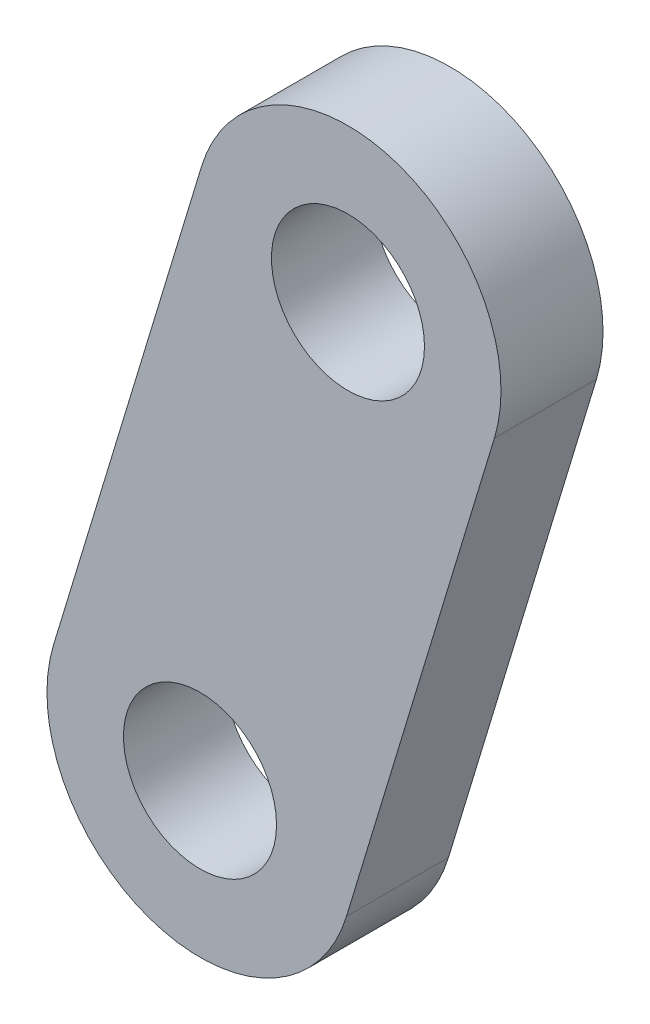
ISO-10303-21;
HEADER;
FILE_DESCRIPTION(('STEP AP214'),'2;1');
FILE_NAME('part.step','',(''),(''),'','','');
FILE_SCHEMA(('AUTOMOTIVE_DESIGN { 1 0 10303 214 1 1 1 1 }'));
ENDSEC;
DATA;
#1=APPLICATION_CONTEXT('core data for automotive mechanical design processes');
#2=APPLICATION_PROTOCOL_DEFINITION('international standard','automotive_design',2000,#1);
#3=PRODUCT_CONTEXT('',#1,'mechanical');
#4=PRODUCT('Part','Part','',(#3));
#5=PRODUCT_RELATED_PRODUCT_CATEGORY('part','',(#4));
#6=PRODUCT_DEFINITION_FORMATION('','',#4);
#7=PRODUCT_DEFINITION_CONTEXT('part definition',#1,'design');
#8=PRODUCT_DEFINITION('design','',#6,#7);
#9=PRODUCT_DEFINITION_SHAPE('','',#8);
#10=(LENGTH_UNIT() NAMED_UNIT(*) SI_UNIT(.MILLI.,.METRE.));
#11=(NAMED_UNIT(*) PLANE_ANGLE_UNIT() SI_UNIT($,.RADIAN.));
#12=(NAMED_UNIT(*) SI_UNIT($,.STERADIAN.) SOLID_ANGLE_UNIT());
#13=UNCERTAINTY_MEASURE_WITH_UNIT(LENGTH_MEASURE(1.E-05),#10,'distance_accuracy_value','');
#14=(GEOMETRIC_REPRESENTATION_CONTEXT(3) GLOBAL_UNCERTAINTY_ASSIGNED_CONTEXT((#13)) GLOBAL_UNIT_ASSIGNED_CONTEXT((#10,
#11,#12)) REPRESENTATION_CONTEXT('',''));
#15=CARTESIAN_POINT('',(0.,0.,0.));
#16=DIRECTION('',(0.,0.,1.));
#17=DIRECTION('',(1.,0.,0.));
#18=AXIS2_PLACEMENT_3D('',#15,#16,#17);
#19=CARTESIAN_POINT('',(0.,0.,10.));
#20=DIRECTION('',(0.,0.,1.));
#21=DIRECTION('',(1.,0.,0.));
#22=AXIS2_PLACEMENT_3D('',#19,#20,#21);
#23=PLANE('',#22);
#24=CARTESIAN_POINT('',(0.,0.,10.));
#25=DIRECTION('',(0.,0.,1.));
#26=DIRECTION('',(1.,0.,0.));
#27=AXIS2_PLACEMENT_3D('',#24,#25,#26);
#28=CIRCLE('',#27,7.5);
#29=CARTESIAN_POINT('',(7.5,0.,10.));
#30=VERTEX_POINT('',#29);
#31=EDGE_CURVE('E112',#30,#30,#28,.T.);
#32=ORIENTED_EDGE('',*,*,#31,.F.);
#33=EDGE_LOOP('',(#32));
#34=FACE_BOUND('',#33,.T.);
#35=CARTESIAN_POINT('',(0.,0.,10.));
#36=DIRECTION('',(0.,0.,1.));
#37=DIRECTION('',(1.,0.,0.));
#38=AXIS2_PLACEMENT_3D('',#35,#36,#37);
#39=CIRCLE('',#38,15.);
#40=CARTESIAN_POINT('',(-14.3553660665021,4.35011092924306,10.));
#41=VERTEX_POINT('',#40);
#42=CARTESIAN_POINT('',(14.3553660665021,-4.35011092924306,10.));
#43=VERTEX_POINT('',#42);
#44=EDGE_CURVE('E92',#41,#43,#39,.T.);
#45=ORIENTED_EDGE('',*,*,#44,.T.);
#46=DIRECTION('',(0.290007395282871,0.957024404433474,0.));
#47=VECTOR('',#46,1.);
#48=CARTESIAN_POINT('',(14.3553660665021,-4.35011092924306,10.));
#49=LINE('',#48,#47);
#50=CARTESIAN_POINT('',(28.8557358306456,43.5011092924306,10.));
#51=VERTEX_POINT('',#50);
#52=EDGE_CURVE('E87',#43,#51,#49,.T.);
#53=ORIENTED_EDGE('',*,*,#52,.T.);
#54=CARTESIAN_POINT('',(14.5003697641435,47.8512202216737,10.));
#55=DIRECTION('',(0.,0.,1.));
#56=DIRECTION('',(1.,0.,0.));
#57=AXIS2_PLACEMENT_3D('',#54,#55,#56);
#58=CIRCLE('',#57,15.);
#59=CARTESIAN_POINT('',(0.145003697641449,52.2013311509167,10.));
#60=VERTEX_POINT('',#59);
#61=EDGE_CURVE('E90',#51,#60,#58,.T.);
#62=ORIENTED_EDGE('',*,*,#61,.T.);
#63=DIRECTION('',(-0.290007395282871,-0.957024404433474,0.));
#64=VECTOR('',#63,1.);
#65=CARTESIAN_POINT('',(-14.3553660665021,4.35011092924306,10.));
#66=LINE('',#65,#64);
#67=EDGE_CURVE('E57',#60,#41,#66,.T.);
#68=ORIENTED_EDGE('',*,*,#67,.T.);
#69=EDGE_LOOP('',(#45,#53,#62,#68));
#70=FACE_BOUND('',#69,.T.);
#71=CARTESIAN_POINT('',(14.5003697641435,47.8512202216737,10.));
#72=DIRECTION('',(0.,0.,1.));
#73=DIRECTION('',(1.,0.,0.));
#74=AXIS2_PLACEMENT_3D('',#71,#72,#73);
#75=CIRCLE('',#74,7.49999999999999);
#76=CARTESIAN_POINT('',(22.0003697641435,47.8512202216737,10.));
#77=VERTEX_POINT('',#76);
#78=EDGE_CURVE('E134',#77,#77,#75,.T.);
#79=ORIENTED_EDGE('',*,*,#78,.F.);
#80=EDGE_LOOP('',(#79));
#81=FACE_BOUND('',#80,.T.);
#82=ADVANCED_FACE('F39',(#34,#70,#81),#23,.T.);
#83=CARTESIAN_POINT('',(0.,0.,0.));
#84=DIRECTION('',(0.,0.,1.));
#85=DIRECTION('',(1.,0.,0.));
#86=AXIS2_PLACEMENT_3D('',#83,#84,#85);
#87=PLANE('',#86);
#88=CARTESIAN_POINT('',(0.,0.,0.));
#89=DIRECTION('',(0.,0.,1.));
#90=DIRECTION('',(1.,0.,0.));
#91=AXIS2_PLACEMENT_3D('',#88,#89,#90);
#92=CIRCLE('',#91,15.);
#93=CARTESIAN_POINT('',(-14.3553660665021,4.35011092924306,0.));
#94=VERTEX_POINT('',#93);
#95=CARTESIAN_POINT('',(14.3553660665021,-4.35011092924306,0.));
#96=VERTEX_POINT('',#95);
#97=EDGE_CURVE('E108',#94,#96,#92,.T.);
#98=ORIENTED_EDGE('',*,*,#97,.F.);
#99=DIRECTION('',(-0.290007395282871,-0.957024404433474,0.));
#100=VECTOR('',#99,1.);
#101=CARTESIAN_POINT('',(-14.3553660665021,4.35011092924306,0.));
#102=LINE('',#101,#100);
#103=CARTESIAN_POINT('',(0.145003697641449,52.2013311509167,0.));
#104=VERTEX_POINT('',#103);
#105=EDGE_CURVE('E80',#104,#94,#102,.T.);
#106=ORIENTED_EDGE('',*,*,#105,.F.);
#107=CARTESIAN_POINT('',(14.5003697641435,47.8512202216737,0.));
#108=DIRECTION('',(0.,0.,1.));
#109=DIRECTION('',(1.,0.,0.));
#110=AXIS2_PLACEMENT_3D('',#107,#108,#109);
#111=CIRCLE('',#110,15.);
#112=CARTESIAN_POINT('',(28.8557358306456,43.5011092924306,0.));
#113=VERTEX_POINT('',#112);
#114=EDGE_CURVE('E74',#113,#104,#111,.T.);
#115=ORIENTED_EDGE('',*,*,#114,.F.);
#116=DIRECTION('',(0.290007395282871,0.957024404433474,0.));
#117=VECTOR('',#116,1.);
#118=CARTESIAN_POINT('',(14.3553660665021,-4.35011092924306,0.));
#119=LINE('',#118,#117);
#120=EDGE_CURVE('E97',#96,#113,#119,.T.);
#121=ORIENTED_EDGE('',*,*,#120,.F.);
#122=EDGE_LOOP('',(#98,#106,#115,#121));
#123=FACE_BOUND('',#122,.T.);
#124=CARTESIAN_POINT('',(0.,0.,0.));
#125=DIRECTION('',(0.,0.,1.));
#126=DIRECTION('',(1.,0.,0.));
#127=AXIS2_PLACEMENT_3D('',#124,#125,#126);
#128=CIRCLE('',#127,7.5);
#129=CARTESIAN_POINT('',(7.5,0.,0.));
#130=VERTEX_POINT('',#129);
#131=EDGE_CURVE('E130',#130,#130,#128,.T.);
#132=ORIENTED_EDGE('',*,*,#131,.T.);
#133=EDGE_LOOP('',(#132));
#134=FACE_BOUND('',#133,.T.);
#135=CARTESIAN_POINT('',(14.5003697641435,47.8512202216737,0.));
#136=DIRECTION('',(0.,0.,1.));
#137=DIRECTION('',(1.,0.,0.));
#138=AXIS2_PLACEMENT_3D('',#135,#136,#137);
#139=CIRCLE('',#138,7.49999999999999);
#140=CARTESIAN_POINT('',(22.0003697641435,47.8512202216737,0.));
#141=VERTEX_POINT('',#140);
#142=EDGE_CURVE('E138',#141,#141,#139,.T.);
#143=ORIENTED_EDGE('',*,*,#142,.T.);
#144=EDGE_LOOP('',(#143));
#145=FACE_BOUND('',#144,.T.);
#146=ADVANCED_FACE('F125',(#123,#134,#145),#87,.F.);
#147=CARTESIAN_POINT('',(0.,0.,10.));
#148=DIRECTION('',(0.,0.,-1.));
#149=DIRECTION('',(-1.,0.,0.));
#150=AXIS2_PLACEMENT_3D('',#147,#148,#149);
#151=CYLINDRICAL_SURFACE('',#150,15.);
#152=ORIENTED_EDGE('',*,*,#97,.T.);
#153=DIRECTION('',(0.,0.,-1.));
#154=VECTOR('',#153,1.);
#155=CARTESIAN_POINT('',(14.3553660665021,-4.35011092924306,10.));
#156=LINE('',#155,#154);
#157=EDGE_CURVE('E11',#43,#96,#156,.T.);
#158=ORIENTED_EDGE('',*,*,#157,.F.);
#159=ORIENTED_EDGE('',*,*,#44,.F.);
#160=DIRECTION('',(0.,0.,-1.));
#161=VECTOR('',#160,1.);
#162=CARTESIAN_POINT('',(-14.3553660665021,4.35011092924306,10.));
#163=LINE('',#162,#161);
#164=EDGE_CURVE('E104',#41,#94,#163,.T.);
#165=ORIENTED_EDGE('',*,*,#164,.T.);
#166=EDGE_LOOP('',(#152,#158,#159,#165));
#167=FACE_BOUND('',#166,.T.);
#168=ADVANCED_FACE('F41',(#167),#151,.T.);
#169=CARTESIAN_POINT('',(14.3553660665021,-4.35011092924306,10.));
#170=DIRECTION('',(-0.957024404433474,0.290007395282871,0.));
#171=DIRECTION('',(-0.290007395282871,-0.957024404433474,0.));
#172=AXIS2_PLACEMENT_3D('',#169,#170,#171);
#173=PLANE('',#172);
#174=ORIENTED_EDGE('',*,*,#120,.T.);
#175=DIRECTION('',(0.,0.,-1.));
#176=VECTOR('',#175,1.);
#177=CARTESIAN_POINT('',(28.8557358306456,43.5011092924306,10.));
#178=LINE('',#177,#176);
#179=EDGE_CURVE('E49',#51,#113,#178,.T.);
#180=ORIENTED_EDGE('',*,*,#179,.F.);
#181=ORIENTED_EDGE('',*,*,#52,.F.);
#182=ORIENTED_EDGE('',*,*,#157,.T.);
#183=EDGE_LOOP('',(#174,#180,#181,#182));
#184=FACE_BOUND('',#183,.T.);
#185=ADVANCED_FACE('F96',(#184),#173,.F.);
#186=CARTESIAN_POINT('',(14.5003697641435,47.8512202216737,10.));
#187=DIRECTION('',(0.,0.,-1.));
#188=DIRECTION('',(-1.,0.,0.));
#189=AXIS2_PLACEMENT_3D('',#186,#187,#188);
#190=CYLINDRICAL_SURFACE('',#189,15.);
#191=ORIENTED_EDGE('',*,*,#114,.T.);
#192=DIRECTION('',(0.,0.,-1.));
#193=VECTOR('',#192,1.);
#194=CARTESIAN_POINT('',(0.145003697641449,52.2013311509167,10.));
#195=LINE('',#194,#193);
#196=EDGE_CURVE('E99',#60,#104,#195,.T.);
#197=ORIENTED_EDGE('',*,*,#196,.F.);
#198=ORIENTED_EDGE('',*,*,#61,.F.);
#199=ORIENTED_EDGE('',*,*,#179,.T.);
#200=EDGE_LOOP('',(#191,#197,#198,#199));
#201=FACE_BOUND('',#200,.T.);
#202=ADVANCED_FACE('F100',(#201),#190,.T.);
#203=CARTESIAN_POINT('',(-14.3553660665021,4.35011092924306,10.));
#204=DIRECTION('',(0.957024404433474,-0.290007395282871,0.));
#205=DIRECTION('',(0.290007395282871,0.957024404433474,0.));
#206=AXIS2_PLACEMENT_3D('',#203,#204,#205);
#207=PLANE('',#206);
#208=ORIENTED_EDGE('',*,*,#105,.T.);
#209=ORIENTED_EDGE('',*,*,#164,.F.);
#210=ORIENTED_EDGE('',*,*,#67,.F.);
#211=ORIENTED_EDGE('',*,*,#196,.T.);
#212=EDGE_LOOP('',(#208,#209,#210,#211));
#213=FACE_BOUND('',#212,.T.);
#214=ADVANCED_FACE('F122',(#213),#207,.F.);
#215=CARTESIAN_POINT('',(0.,0.,10.));
#216=DIRECTION('',(0.,0.,-1.));
#217=DIRECTION('',(-1.,0.,0.));
#218=AXIS2_PLACEMENT_3D('',#215,#216,#217);
#219=CYLINDRICAL_SURFACE('',#218,7.5);
#220=ORIENTED_EDGE('',*,*,#31,.T.);
#221=EDGE_LOOP('',(#220));
#222=FACE_BOUND('',#221,.T.);
#223=ORIENTED_EDGE('',*,*,#131,.F.);
#224=EDGE_LOOP('',(#223));
#225=FACE_BOUND('',#224,.T.);
#226=ADVANCED_FACE('F157',(#222,#225),#219,.F.);
#227=CARTESIAN_POINT('',(14.5003697641435,47.8512202216737,10.));
#228=DIRECTION('',(0.,0.,-1.));
#229=DIRECTION('',(-1.,0.,0.));
#230=AXIS2_PLACEMENT_3D('',#227,#228,#229);
#231=CYLINDRICAL_SURFACE('',#230,7.49999999999999);
#232=ORIENTED_EDGE('',*,*,#78,.T.);
#233=EDGE_LOOP('',(#232));
#234=FACE_BOUND('',#233,.T.);
#235=ORIENTED_EDGE('',*,*,#142,.F.);
#236=EDGE_LOOP('',(#235));
#237=FACE_BOUND('',#236,.T.);
#238=ADVANCED_FACE('F146',(#234,#237),#231,.F.);
#239=CLOSED_SHELL('',(#82,#146,#168,#185,#202,#214,#226,#238));
#240=MANIFOLD_SOLID_BREP('B2',#239);
#241=ADVANCED_BREP_SHAPE_REPRESENTATION('',(#18,#240),#14);
#242=SHAPE_DEFINITION_REPRESENTATION(#9,#241);
ENDSEC;
END-ISO-10303-21;
